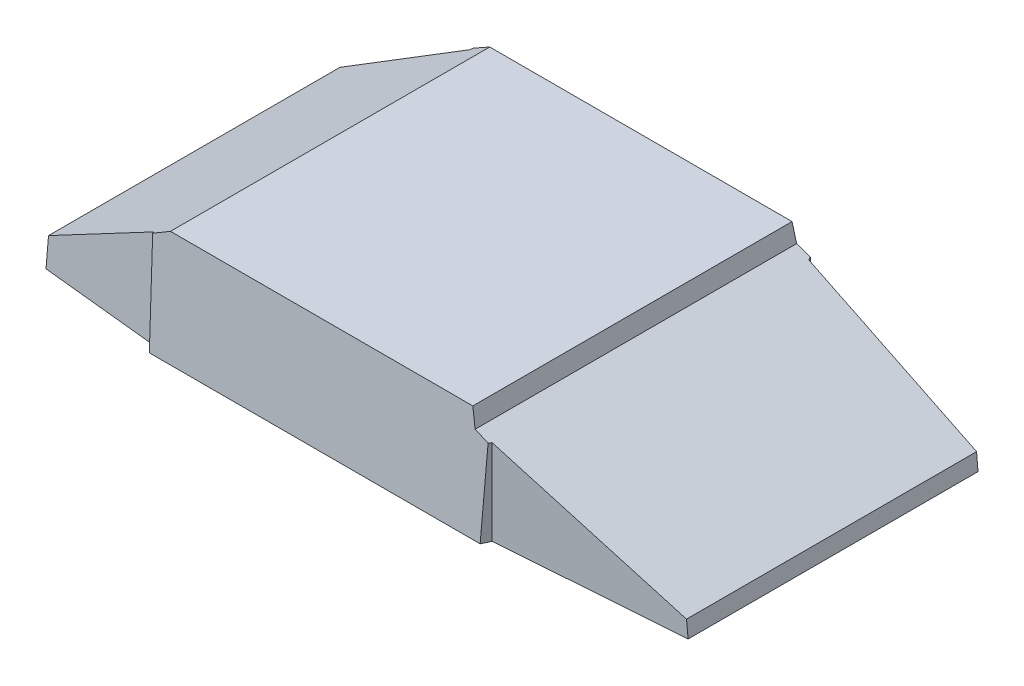
ISO-10303-21;
HEADER;
FILE_DESCRIPTION(('STEP AP214'),'2;1');
FILE_NAME('part.step','',(''),(''),'','','');
FILE_SCHEMA(('AUTOMOTIVE_DESIGN { 1 0 10303 214 1 1 1 1 }'));
ENDSEC;
DATA;
#1=APPLICATION_CONTEXT('core data for automotive mechanical design processes');
#2=APPLICATION_PROTOCOL_DEFINITION('international standard','automotive_design',2000,#1);
#3=PRODUCT_CONTEXT('',#1,'mechanical');
#4=PRODUCT('Part','Part','',(#3));
#5=PRODUCT_RELATED_PRODUCT_CATEGORY('part','',(#4));
#6=PRODUCT_DEFINITION_FORMATION('','',#4);
#7=PRODUCT_DEFINITION_CONTEXT('part definition',#1,'design');
#8=PRODUCT_DEFINITION('design','',#6,#7);
#9=PRODUCT_DEFINITION_SHAPE('','',#8);
#10=(LENGTH_UNIT() NAMED_UNIT(*) SI_UNIT(.MILLI.,.METRE.));
#11=(NAMED_UNIT(*) PLANE_ANGLE_UNIT() SI_UNIT($,.RADIAN.));
#12=(NAMED_UNIT(*) SI_UNIT($,.STERADIAN.) SOLID_ANGLE_UNIT());
#13=UNCERTAINTY_MEASURE_WITH_UNIT(LENGTH_MEASURE(1.E-05),#10,'distance_accuracy_value','');
#14=(GEOMETRIC_REPRESENTATION_CONTEXT(3) GLOBAL_UNCERTAINTY_ASSIGNED_CONTEXT((#13)) GLOBAL_UNIT_ASSIGNED_CONTEXT((#10,
#11,#12)) REPRESENTATION_CONTEXT('',''));
#15=CARTESIAN_POINT('',(0.,0.,0.));
#16=DIRECTION('',(0.,0.,1.));
#17=DIRECTION('',(1.,0.,0.));
#18=AXIS2_PLACEMENT_3D('',#15,#16,#17);
#19=CARTESIAN_POINT('',(0.,158.,0.));
#20=DIRECTION('',(0.,1.,0.));
#21=DIRECTION('',(0.,0.,1.));
#22=AXIS2_PLACEMENT_3D('',#19,#20,#21);
#23=PLANE('',#22);
#24=DIRECTION('',(1.,0.,0.));
#25=VECTOR('',#24,1.);
#26=CARTESIAN_POINT('',(-180.,158.,84.9999999999999));
#27=LINE('',#26,#25);
#28=CARTESIAN_POINT('',(-97.,158.,84.9999999999999));
#29=VERTEX_POINT('',#28);
#30=CARTESIAN_POINT('',(64.,158.,85.));
#31=VERTEX_POINT('',#30);
#32=EDGE_CURVE('E355',#29,#31,#27,.T.);
#33=ORIENTED_EDGE('',*,*,#32,.T.);
#34=DIRECTION('',(0.,0.,-1.));
#35=VECTOR('',#34,1.);
#36=CARTESIAN_POINT('',(64.,158.,95.));
#37=LINE('',#36,#35);
#38=CARTESIAN_POINT('',(64.,158.,-85.0000000000001));
#39=VERTEX_POINT('',#38);
#40=EDGE_CURVE('E349',#31,#39,#37,.T.);
#41=ORIENTED_EDGE('',*,*,#40,.T.);
#42=DIRECTION('',(1.,0.,0.));
#43=VECTOR('',#42,1.);
#44=CARTESIAN_POINT('',(-180.,158.,-85.0000000000001));
#45=LINE('',#44,#43);
#46=CARTESIAN_POINT('',(-97.,158.,-84.9999999999999));
#47=VERTEX_POINT('',#46);
#48=EDGE_CURVE('E352',#47,#39,#45,.T.);
#49=ORIENTED_EDGE('',*,*,#48,.F.);
#50=DIRECTION('',(0.,0.,-1.));
#51=VECTOR('',#50,1.);
#52=CARTESIAN_POINT('',(-97.,158.,95.));
#53=LINE('',#52,#51);
#54=EDGE_CURVE('E346',#29,#47,#53,.T.);
#55=ORIENTED_EDGE('',*,*,#54,.F.);
#56=EDGE_LOOP('',(#33,#41,#49,#55));
#57=FACE_BOUND('',#56,.T.);
#58=ADVANCED_FACE('F43',(#57),#23,.T.);
#59=CARTESIAN_POINT('',(-180.,158.,-85.0000000000001));
#60=DIRECTION('',(0.,-0.063164753996691,0.998003113147718));
#61=DIRECTION('',(0.,-0.998003113147719,-0.063164753996691));
#62=AXIS2_PLACEMENT_3D('',#59,#60,#61);
#63=PLANE('',#62);
#64=DIRECTION('',(0.0294414403161479,0.997570485622409,0.0631373725077474));
#65=VECTOR('',#64,1.);
#66=CARTESIAN_POINT('',(73.0599801105196,150.561202737672,-85.4708099533119));
#67=LINE('',#66,#65);
#68=CARTESIAN_POINT('',(72.9178759529951,145.746257819608,-85.7755533025565));
#69=VERTEX_POINT('',#68);
#70=CARTESIAN_POINT('',(71.5677601078548,100.,-88.6708860759494));
#71=VERTEX_POINT('',#70);
#72=EDGE_CURVE('E412',#69,#71,#67,.F.);
#73=ORIENTED_EDGE('',*,*,#72,.T.);
#74=DIRECTION('',(-1.,0.,0.));
#75=VECTOR('',#74,1.);
#76=CARTESIAN_POINT('',(-180.,100.,-88.6708860759495));
#77=LINE('',#76,#75);
#78=CARTESIAN_POINT('',(-104.567760107855,100.,-88.6708860759494));
#79=VERTEX_POINT('',#78);
#80=EDGE_CURVE('E59',#71,#79,#77,.T.);
#81=ORIENTED_EDGE('',*,*,#80,.T.);
#82=DIRECTION('',(0.029441440316148,-0.997570485622409,-0.0631373725077474));
#83=VECTOR('',#82,1.);
#84=CARTESIAN_POINT('',(-106.343423189899,160.16516393342,-84.8629643080114));
#85=LINE('',#84,#83);
#86=CARTESIAN_POINT('',(-106.123798843026,152.723586211262,-85.3339502397936));
#87=VERTEX_POINT('',#86);
#88=EDGE_CURVE('E384',#79,#87,#85,.F.);
#89=ORIENTED_EDGE('',*,*,#88,.T.);
#90=DIRECTION('',(-0.865229995951052,-0.500373973562054,-0.0316692388330415));
#91=VECTOR('',#90,1.);
#92=CARTESIAN_POINT('',(-159.135704509157,122.066098597114,-87.2742975571448));
#93=LINE('',#92,#91);
#94=EDGE_CURVE('E392',#47,#87,#93,.T.);
#95=ORIENTED_EDGE('',*,*,#94,.F.);
#96=ORIENTED_EDGE('',*,*,#48,.T.);
#97=DIRECTION('',(0.187628780777024,-0.980278589555026,-0.0620429487060142));
#98=VECTOR('',#97,1.);
#99=CARTESIAN_POINT('',(63.726694688933,159.427901112724,-84.9096265118529));
#100=LINE('',#99,#98);
#101=CARTESIAN_POINT('',(65.8291232913641,148.443628143001,-85.6048336618354));
#102=VERTEX_POINT('',#101);
#103=EDGE_CURVE('E418',#39,#102,#100,.T.);
#104=ORIENTED_EDGE('',*,*,#103,.T.);
#105=DIRECTION('',(0.934387269483992,-0.35554752882042,-0.022503008153191));
#106=VECTOR('',#105,1.);
#107=CARTESIAN_POINT('',(62.0316313598313,149.888627359137,-85.5133780152445));
#108=LINE('',#107,#106);
#109=EDGE_CURVE('E52',#102,#69,#108,.T.);
#110=ORIENTED_EDGE('',*,*,#109,.T.);
#111=EDGE_LOOP('',(#73,#81,#89,#95,#96,#104,#110));
#112=FACE_BOUND('',#111,.T.);
#113=ADVANCED_FACE('F424',(#112),#63,.F.);
#114=CARTESIAN_POINT('',(-180.,158.,84.9999999999999));
#115=DIRECTION('',(0.,-0.063164753996691,-0.998003113147718));
#116=DIRECTION('',(0.,0.998003113147719,-0.063164753996691));
#117=AXIS2_PLACEMENT_3D('',#114,#115,#116);
#118=PLANE('',#117);
#119=DIRECTION('',(-0.0294414403161479,0.997570485622409,-0.0631373725077474));
#120=VECTOR('',#119,1.);
#121=CARTESIAN_POINT('',(-106.3434231899,160.16516393342,84.8629643080113));
#122=LINE('',#121,#120);
#123=CARTESIAN_POINT('',(-106.123798843026,152.723586211262,85.3339502397935));
#124=VERTEX_POINT('',#123);
#125=CARTESIAN_POINT('',(-104.567760107855,100.,88.6708860759493));
#126=VERTEX_POINT('',#125);
#127=EDGE_CURVE('E407',#124,#126,#122,.F.);
#128=ORIENTED_EDGE('',*,*,#127,.T.);
#129=DIRECTION('',(1.,0.,0.));
#130=VECTOR('',#129,1.);
#131=CARTESIAN_POINT('',(-180.,100.,88.6708860759493));
#132=LINE('',#131,#130);
#133=CARTESIAN_POINT('',(71.5677601078549,100.,88.6708860759493));
#134=VERTEX_POINT('',#133);
#135=EDGE_CURVE('E462',#126,#134,#132,.T.);
#136=ORIENTED_EDGE('',*,*,#135,.T.);
#137=DIRECTION('',(-0.029441440316148,-0.997570485622409,0.0631373725077474));
#138=VECTOR('',#137,1.);
#139=CARTESIAN_POINT('',(73.0599801105197,150.561202737672,85.4708099533118));
#140=LINE('',#139,#138);
#141=CARTESIAN_POINT('',(72.9178759529952,145.746257819608,85.7755533025564));
#142=VERTEX_POINT('',#141);
#143=EDGE_CURVE('E388',#134,#142,#140,.F.);
#144=ORIENTED_EDGE('',*,*,#143,.T.);
#145=DIRECTION('',(0.934387269483992,-0.35554752882042,0.0225030081531912));
#146=VECTOR('',#145,1.);
#147=CARTESIAN_POINT('',(-151.986788471782,231.325653288657,80.3591358678065));
#148=LINE('',#147,#146);
#149=CARTESIAN_POINT('',(65.8291232913641,148.443628143001,85.6048336618354));
#150=VERTEX_POINT('',#149);
#151=EDGE_CURVE('E398',#150,#142,#148,.T.);
#152=ORIENTED_EDGE('',*,*,#151,.F.);
#153=DIRECTION('',(0.187628780777024,-0.980278589555026,0.0620429487060143));
#154=VECTOR('',#153,1.);
#155=CARTESIAN_POINT('',(55.4100875122871,202.878548285527,82.1595855515489));
#156=LINE('',#155,#154);
#157=EDGE_CURVE('E395',#31,#150,#156,.T.);
#158=ORIENTED_EDGE('',*,*,#157,.F.);
#159=ORIENTED_EDGE('',*,*,#32,.F.);
#160=DIRECTION('',(-0.865229995951052,-0.500373973562054,0.0316692388330412));
#161=VECTOR('',#160,1.);
#162=CARTESIAN_POINT('',(-97.2740117538728,157.841535371254,85.0100294068826));
#163=LINE('',#162,#161);
#164=EDGE_CURVE('E415',#29,#124,#163,.T.);
#165=ORIENTED_EDGE('',*,*,#164,.T.);
#166=EDGE_LOOP('',(#128,#136,#144,#152,#158,#159,#165));
#167=FACE_BOUND('',#166,.T.);
#168=ADVANCED_FACE('F549',(#167),#118,.F.);
#169=CARTESIAN_POINT('',(180.,0.,-95.0000000000001));
#170=DIRECTION('',(-0.9958153503349,-0.0913881175940254,0.));
#171=DIRECTION('',(0.0913881175940254,-0.995815350334901,0.));
#172=AXIS2_PLACEMENT_3D('',#169,#170,#171);
#173=PLANE('',#172);
#174=DIRECTION('',(0.0913860685727554,-0.995793023068648,-0.00669639295576236));
#175=VECTOR('',#174,1.);
#176=CARTESIAN_POINT('',(180.104950629932,-1.14359996754022,76.4923096521169));
#177=LINE('',#176,#175);
#178=CARTESIAN_POINT('',(170.015250636154,108.799337895696,77.2316411171782));
#179=VERTEX_POINT('',#178);
#180=CARTESIAN_POINT('',(170.822784810127,100.,77.1724683544303));
#181=VERTEX_POINT('',#180);
#182=EDGE_CURVE('E336',#179,#181,#177,.T.);
#183=ORIENTED_EDGE('',*,*,#182,.T.);
#184=DIRECTION('',(0.,0.,-1.));
#185=VECTOR('',#184,1.);
#186=CARTESIAN_POINT('',(170.822784810127,100.,-95.0000000000001));
#187=LINE('',#186,#185);
#188=CARTESIAN_POINT('',(170.822784810127,100.,-77.1724683544304));
#189=VERTEX_POINT('',#188);
#190=EDGE_CURVE('E435',#181,#189,#187,.T.);
#191=ORIENTED_EDGE('',*,*,#190,.T.);
#192=DIRECTION('',(-0.0913860685727554,0.995793023068648,-0.00669639295576233));
#193=VECTOR('',#192,1.);
#194=CARTESIAN_POINT('',(179.988678795022,0.123362095623873,-76.5008295710544));
#195=LINE('',#194,#193);
#196=CARTESIAN_POINT('',(170.015250636154,108.799337895696,-77.2316411171783));
#197=VERTEX_POINT('',#196);
#198=EDGE_CURVE('E339',#189,#197,#195,.T.);
#199=ORIENTED_EDGE('',*,*,#198,.T.);
#200=DIRECTION('',(0.,0.,-1.));
#201=VECTOR('',#200,1.);
#202=CARTESIAN_POINT('',(170.015250636154,108.799337895696,-95.0000000000001));
#203=LINE('',#202,#201);
#204=EDGE_CURVE('E363',#179,#197,#203,.T.);
#205=ORIENTED_EDGE('',*,*,#204,.F.);
#206=EDGE_LOOP('',(#183,#191,#199,#205));
#207=FACE_BOUND('',#206,.T.);
#208=ADVANCED_FACE('F610',(#207),#173,.F.);
#209=CARTESIAN_POINT('',(-180.,0.,-95.0000000000001));
#210=DIRECTION('',(0.9958153503349,-0.0913881175940254,0.));
#211=DIRECTION('',(0.0913881175940254,0.995815350334901,0.));
#212=AXIS2_PLACEMENT_3D('',#209,#210,#211);
#213=PLANE('',#212);
#214=DIRECTION('',(-0.0913841154534666,-0.995771740803294,0.00935861423318627));
#215=VECTOR('',#214,1.);
#216=CARTESIAN_POINT('',(-179.984178269354,0.172402306349999,-76.5016202977167));
#217=LINE('',#216,#215);
#218=CARTESIAN_POINT('',(-169.339265582219,116.165244000644,-77.5917619584474));
#219=VERTEX_POINT('',#218);
#220=CARTESIAN_POINT('',(-170.822784810127,100.,-77.4398352905292));
#221=VERTEX_POINT('',#220);
#222=EDGE_CURVE('E341',#219,#221,#217,.T.);
#223=ORIENTED_EDGE('',*,*,#222,.T.);
#224=DIRECTION('',(0.,0.,1.));
#225=VECTOR('',#224,1.);
#226=CARTESIAN_POINT('',(-170.822784810127,100.,-95.0000000000001));
#227=LINE('',#226,#225);
#228=CARTESIAN_POINT('',(-170.822784810127,100.,77.4398352905292));
#229=VERTEX_POINT('',#228);
#230=EDGE_CURVE('E453',#221,#229,#227,.T.);
#231=ORIENTED_EDGE('',*,*,#230,.T.);
#232=DIRECTION('',(0.0913841154534666,0.995771740803294,0.00935861423318624));
#233=VECTOR('',#232,1.);
#234=CARTESIAN_POINT('',(-180.146671719232,-1.59821597508241,76.4849794022473));
#235=LINE('',#234,#233);
#236=CARTESIAN_POINT('',(-169.339265582219,116.165244000644,77.5917619584474));
#237=VERTEX_POINT('',#236);
#238=EDGE_CURVE('E344',#229,#237,#235,.T.);
#239=ORIENTED_EDGE('',*,*,#238,.T.);
#240=DIRECTION('',(0.,0.,1.));
#241=VECTOR('',#240,1.);
#242=CARTESIAN_POINT('',(-169.339265582219,116.165244000644,-95.0000000000001));
#243=LINE('',#242,#241);
#244=EDGE_CURVE('E358',#219,#237,#243,.T.);
#245=ORIENTED_EDGE('',*,*,#244,.F.);
#246=EDGE_LOOP('',(#223,#231,#239,#245));
#247=FACE_BOUND('',#246,.T.);
#248=ADVANCED_FACE('F583',(#247),#213,.F.);
#249=CARTESIAN_POINT('',(-97.,158.,95.));
#250=DIRECTION('',(-0.500625085174105,0.865664209780224,0.));
#251=DIRECTION('',(-0.865664209780224,-0.500625085174106,0.));
#252=AXIS2_PLACEMENT_3D('',#249,#250,#251);
#253=PLANE('',#252);
#254=DIRECTION('',(-0.862282398918557,-0.498669339133623,-0.0883060288049115));
#255=VECTOR('',#254,1.);
#256=CARTESIAN_POINT('',(-96.2385526564313,158.440355090257,85.0779795472329));
#257=LINE('',#256,#255);
#258=CARTESIAN_POINT('',(-106.744883446956,152.364404753568,84.0020300084442));
#259=VERTEX_POINT('',#258);
#260=EDGE_CURVE('E375',#259,#237,#257,.T.);
#261=ORIENTED_EDGE('',*,*,#260,.F.);
#262=DIRECTION('',(-0.410534624247137,-0.237417614022441,-0.880394342806764));
#263=VECTOR('',#262,1.);
#264=CARTESIAN_POINT('',(-121.595561420384,143.77606086532,52.1546483201699));
#265=LINE('',#264,#263);
#266=EDGE_CURVE('E405',#259,#124,#265,.F.);
#267=ORIENTED_EDGE('',*,*,#266,.T.);
#268=ORIENTED_EDGE('',*,*,#164,.F.);
#269=ORIENTED_EDGE('',*,*,#54,.T.);
#270=ORIENTED_EDGE('',*,*,#94,.T.);
#271=DIRECTION('',(0.410534624247138,0.237417614022441,-0.880394342806763));
#272=VECTOR('',#271,1.);
#273=CARTESIAN_POINT('',(-112.39996902167,149.093993818793,-71.8746598573967));
#274=LINE('',#273,#272);
#275=CARTESIAN_POINT('',(-106.744883446956,152.364404753568,-84.0020300084442));
#276=VERTEX_POINT('',#275);
#277=EDGE_CURVE('E386',#87,#276,#274,.F.);
#278=ORIENTED_EDGE('',*,*,#277,.T.);
#279=DIRECTION('',(0.862282398918557,0.498669339133623,-0.0883060288049118));
#280=VECTOR('',#279,1.);
#281=CARTESIAN_POINT('',(-110.706052184237,150.073608375381,-83.596368149807));
#282=LINE('',#281,#280);
#283=EDGE_CURVE('E372',#219,#276,#282,.T.);
#284=ORIENTED_EDGE('',*,*,#283,.F.);
#285=ORIENTED_EDGE('',*,*,#244,.T.);
#286=EDGE_LOOP('',(#261,#267,#268,#269,#270,#278,#284,#285));
#287=FACE_BOUND('',#286,.T.);
#288=ADVANCED_FACE('F590',(#287),#253,.T.);
#289=CARTESIAN_POINT('',(65.8291232913641,148.443628143001,95.));
#290=DIRECTION('',(0.982170760658832,0.187990949002477,0.));
#291=DIRECTION('',(-0.187990949002477,0.982170760658832,0.));
#292=AXIS2_PLACEMENT_3D('',#289,#290,#291);
#293=PLANE('',#292);
#294=DIRECTION('',(0.,0.,-1.));
#295=VECTOR('',#294,1.);
#296=CARTESIAN_POINT('',(65.8291232913641,148.443628143001,95.));
#297=LINE('',#296,#295);
#298=EDGE_CURVE('E347',#150,#102,#297,.T.);
#299=ORIENTED_EDGE('',*,*,#298,.T.);
#300=ORIENTED_EDGE('',*,*,#103,.F.);
#301=ORIENTED_EDGE('',*,*,#40,.F.);
#302=ORIENTED_EDGE('',*,*,#157,.T.);
#303=EDGE_LOOP('',(#299,#300,#301,#302));
#304=FACE_BOUND('',#303,.T.);
#305=ADVANCED_FACE('F598',(#304),#293,.T.);
#306=CARTESIAN_POINT('',(65.8291232913641,148.443628143001,95.));
#307=DIRECTION('',(0.355637585058758,0.93462393939679,0.));
#308=DIRECTION('',(-0.93462393939679,0.355637585058758,0.));
#309=AXIS2_PLACEMENT_3D('',#306,#307,#308);
#310=PLANE('',#309);
#311=DIRECTION('',(0.932439811112521,-0.354806493455244,0.0683253309866941));
#312=VECTOR('',#311,1.);
#313=CARTESIAN_POINT('',(77.288250871582,144.083268550522,-84.0262919619962));
#314=LINE('',#313,#312);
#315=CARTESIAN_POINT('',(73.6078126672081,145.483727173277,-84.2959792442132));
#316=VERTEX_POINT('',#315);
#317=EDGE_CURVE('E369',#316,#197,#314,.T.);
#318=ORIENTED_EDGE('',*,*,#317,.F.);
#319=DIRECTION('',(0.417257442210607,-0.158772339162795,0.894811472454749));
#320=VECTOR('',#319,1.);
#321=CARTESIAN_POINT('',(83.2459561940035,141.81627768495,-63.6269137501363));
#322=LINE('',#321,#320);
#323=EDGE_CURVE('E410',#316,#69,#322,.F.);
#324=ORIENTED_EDGE('',*,*,#323,.T.);
#325=ORIENTED_EDGE('',*,*,#109,.F.);
#326=ORIENTED_EDGE('',*,*,#298,.F.);
#327=ORIENTED_EDGE('',*,*,#151,.T.);
#328=DIRECTION('',(-0.417257442210608,0.158772339162795,0.894811472454749));
#329=VECTOR('',#328,1.);
#330=CARTESIAN_POINT('',(73.8803435681921,145.380025323373,83.7115348410005));
#331=LINE('',#330,#329);
#332=CARTESIAN_POINT('',(73.6078126672081,145.483727173277,84.2959792442132));
#333=VERTEX_POINT('',#332);
#334=EDGE_CURVE('E390',#142,#333,#331,.F.);
#335=ORIENTED_EDGE('',*,*,#334,.T.);
#336=DIRECTION('',(-0.932439811112521,0.354806493455244,0.0683253309866944));
#337=VECTOR('',#336,1.);
#338=CARTESIAN_POINT('',(65.1834917148896,148.689300059818,84.91327862434));
#339=LINE('',#338,#337);
#340=EDGE_CURVE('E366',#179,#333,#339,.T.);
#341=ORIENTED_EDGE('',*,*,#340,.F.);
#342=ORIENTED_EDGE('',*,*,#204,.T.);
#343=EDGE_LOOP('',(#318,#324,#325,#326,#327,#335,#341,#342));
#344=FACE_BOUND('',#343,.T.);
#345=ADVANCED_FACE('F600',(#344),#310,.T.);
#346=CARTESIAN_POINT('',(64.,-1.2E-05,85.));
#347=DIRECTION('',(-0.0730799287960106,0.,-0.997326087098483));
#348=DIRECTION('',(-0.997326087098483,0.,0.0730799287960106));
#349=AXIS2_PLACEMENT_3D('',#346,#347,#348);
#350=PLANE('',#349);
#351=DIRECTION('',(0.,-1.,0.));
#352=VECTOR('',#351,1.);
#353=CARTESIAN_POINT('',(73.6078126672081,0.,84.2959792442132));
#354=LINE('',#353,#352);
#355=CARTESIAN_POINT('',(73.6078126672081,100.,84.2959792442132));
#356=VERTEX_POINT('',#355);
#357=EDGE_CURVE('E381',#333,#356,#354,.T.);
#358=ORIENTED_EDGE('',*,*,#357,.T.);
#359=DIRECTION('',(0.997326087098483,0.,-0.0730799287960106));
#360=VECTOR('',#359,1.);
#361=CARTESIAN_POINT('',(64.,100.,85.));
#362=LINE('',#361,#360);
#363=EDGE_CURVE('E450',#356,#181,#362,.T.);
#364=ORIENTED_EDGE('',*,*,#363,.T.);
#365=ORIENTED_EDGE('',*,*,#182,.F.);
#366=ORIENTED_EDGE('',*,*,#340,.T.);
#367=EDGE_LOOP('',(#358,#364,#365,#366));
#368=FACE_BOUND('',#367,.T.);
#369=ADVANCED_FACE('F608',(#368),#350,.F.);
#370=CARTESIAN_POINT('',(64.,-1.2E-05,-85.0000000000001));
#371=DIRECTION('',(-0.0730799287960104,0.,0.997326087098483));
#372=DIRECTION('',(0.997326087098483,0.,0.0730799287960104));
#373=AXIS2_PLACEMENT_3D('',#370,#371,#372);
#374=PLANE('',#373);
#375=ORIENTED_EDGE('',*,*,#198,.F.);
#376=DIRECTION('',(-0.997326087098483,0.,-0.0730799287960104));
#377=VECTOR('',#376,1.);
#378=CARTESIAN_POINT('',(64.,100.,-85.0000000000001));
#379=LINE('',#378,#377);
#380=CARTESIAN_POINT('',(73.6078126672081,100.,-84.2959792442132));
#381=VERTEX_POINT('',#380);
#382=EDGE_CURVE('E432',#189,#381,#379,.T.);
#383=ORIENTED_EDGE('',*,*,#382,.T.);
#384=DIRECTION('',(0.,1.,0.));
#385=VECTOR('',#384,1.);
#386=CARTESIAN_POINT('',(73.6078126672081,158.,-84.2959792442133));
#387=LINE('',#386,#385);
#388=EDGE_CURVE('E403',#381,#316,#387,.T.);
#389=ORIENTED_EDGE('',*,*,#388,.T.);
#390=ORIENTED_EDGE('',*,*,#317,.T.);
#391=EDGE_LOOP('',(#375,#383,#389,#390));
#392=FACE_BOUND('',#391,.T.);
#393=ADVANCED_FACE('F613',(#392),#374,.F.);
#394=CARTESIAN_POINT('',(-180.,-1.2E-05,-76.5));
#395=DIRECTION('',(0.101876803556506,0.,0.994797022963534));
#396=DIRECTION('',(0.994797022963534,0.,-0.101876803556506));
#397=AXIS2_PLACEMENT_3D('',#394,#395,#396);
#398=PLANE('',#397);
#399=DIRECTION('',(0.,-1.,0.));
#400=VECTOR('',#399,1.);
#401=CARTESIAN_POINT('',(-106.744883446956,0.,-84.0020300084442));
#402=LINE('',#401,#400);
#403=CARTESIAN_POINT('',(-106.744883446956,100.,-84.0020300084442));
#404=VERTEX_POINT('',#403);
#405=EDGE_CURVE('E378',#276,#404,#402,.T.);
#406=ORIENTED_EDGE('',*,*,#405,.T.);
#407=DIRECTION('',(-0.994797022963534,0.,0.101876803556506));
#408=VECTOR('',#407,1.);
#409=CARTESIAN_POINT('',(-180.,100.,-76.5));
#410=LINE('',#409,#408);
#411=EDGE_CURVE('E447',#404,#221,#410,.T.);
#412=ORIENTED_EDGE('',*,*,#411,.T.);
#413=ORIENTED_EDGE('',*,*,#222,.F.);
#414=ORIENTED_EDGE('',*,*,#283,.T.);
#415=EDGE_LOOP('',(#406,#412,#413,#414));
#416=FACE_BOUND('',#415,.T.);
#417=ADVANCED_FACE('F587',(#416),#398,.F.);
#418=CARTESIAN_POINT('',(-180.,-1.2E-05,76.5));
#419=DIRECTION('',(0.101876803556505,0.,-0.994797022963534));
#420=DIRECTION('',(-0.994797022963534,0.,-0.101876803556505));
#421=AXIS2_PLACEMENT_3D('',#418,#419,#420);
#422=PLANE('',#421);
#423=ORIENTED_EDGE('',*,*,#238,.F.);
#424=DIRECTION('',(0.994797022963534,0.,0.101876803556505));
#425=VECTOR('',#424,1.);
#426=CARTESIAN_POINT('',(-180.,100.,76.5));
#427=LINE('',#426,#425);
#428=CARTESIAN_POINT('',(-106.744883446956,100.,84.0020300084442));
#429=VERTEX_POINT('',#428);
#430=EDGE_CURVE('E459',#229,#429,#427,.T.);
#431=ORIENTED_EDGE('',*,*,#430,.T.);
#432=DIRECTION('',(0.,1.,0.));
#433=VECTOR('',#432,1.);
#434=CARTESIAN_POINT('',(-106.744883446956,158.,84.0020300084442));
#435=LINE('',#434,#433);
#436=EDGE_CURVE('E401',#429,#259,#435,.T.);
#437=ORIENTED_EDGE('',*,*,#436,.T.);
#438=ORIENTED_EDGE('',*,*,#260,.T.);
#439=EDGE_LOOP('',(#423,#431,#437,#438));
#440=FACE_BOUND('',#439,.T.);
#441=ADVANCED_FACE('F561',(#440),#422,.F.);
#442=CARTESIAN_POINT('',(-97.,-1.2E-05,-104.9));
#443=DIRECTION('',(-0.906307787036647,0.,-0.422618261740706));
#444=DIRECTION('',(0.,-1.,0.));
#445=AXIS2_PLACEMENT_3D('',#442,#443,#444);
#446=PLANE('',#445);
#447=ORIENTED_EDGE('',*,*,#88,.F.);
#448=DIRECTION('',(0.422618261740706,0.,-0.906307787036647));
#449=VECTOR('',#448,1.);
#450=CARTESIAN_POINT('',(-97.,100.,-104.9));
#451=LINE('',#450,#449);
#452=EDGE_CURVE('E444',#79,#404,#451,.F.);
#453=ORIENTED_EDGE('',*,*,#452,.T.);
#454=ORIENTED_EDGE('',*,*,#405,.F.);
#455=ORIENTED_EDGE('',*,*,#277,.F.);
#456=EDGE_LOOP('',(#447,#453,#454,#455));
#457=FACE_BOUND('',#456,.T.);
#458=ADVANCED_FACE('F554',(#457),#446,.T.);
#459=CARTESIAN_POINT('',(64.,-1.2E-05,104.9));
#460=DIRECTION('',(0.906307787036647,0.,0.422618261740706));
#461=DIRECTION('',(0.,-1.,0.));
#462=AXIS2_PLACEMENT_3D('',#459,#460,#461);
#463=PLANE('',#462);
#464=ORIENTED_EDGE('',*,*,#143,.F.);
#465=DIRECTION('',(-0.422618261740706,0.,0.906307787036647));
#466=VECTOR('',#465,1.);
#467=CARTESIAN_POINT('',(64.,100.,104.9));
#468=LINE('',#467,#466);
#469=EDGE_CURVE('E456',#134,#356,#468,.F.);
#470=ORIENTED_EDGE('',*,*,#469,.T.);
#471=ORIENTED_EDGE('',*,*,#357,.F.);
#472=ORIENTED_EDGE('',*,*,#334,.F.);
#473=EDGE_LOOP('',(#464,#470,#471,#472));
#474=FACE_BOUND('',#473,.T.);
#475=ADVANCED_FACE('F560',(#474),#463,.T.);
#476=CARTESIAN_POINT('',(-106.744883446956,-1.2E-05,84.0020300084442));
#477=DIRECTION('',(-0.906307787036648,0.,0.422618261740704));
#478=DIRECTION('',(0.,-1.,0.));
#479=AXIS2_PLACEMENT_3D('',#476,#477,#478);
#480=PLANE('',#479);
#481=ORIENTED_EDGE('',*,*,#436,.F.);
#482=DIRECTION('',(-0.422618261740704,0.,-0.906307787036648));
#483=VECTOR('',#482,1.);
#484=CARTESIAN_POINT('',(-106.744883446956,100.,84.0020300084442));
#485=LINE('',#484,#483);
#486=EDGE_CURVE('E311',#429,#126,#485,.F.);
#487=ORIENTED_EDGE('',*,*,#486,.T.);
#488=ORIENTED_EDGE('',*,*,#127,.F.);
#489=ORIENTED_EDGE('',*,*,#266,.F.);
#490=EDGE_LOOP('',(#481,#487,#488,#489));
#491=FACE_BOUND('',#490,.T.);
#492=ADVANCED_FACE('F567',(#491),#480,.T.);
#493=CARTESIAN_POINT('',(73.6078126672081,-1.2E-05,-84.2959792442133));
#494=DIRECTION('',(0.906307787036647,0.,-0.422618261740705));
#495=DIRECTION('',(0.,-1.,0.));
#496=AXIS2_PLACEMENT_3D('',#493,#494,#495);
#497=PLANE('',#496);
#498=ORIENTED_EDGE('',*,*,#388,.F.);
#499=DIRECTION('',(0.422618261740705,0.,0.906307787036647));
#500=VECTOR('',#499,1.);
#501=CARTESIAN_POINT('',(73.6078126672081,100.,-84.2959792442133));
#502=LINE('',#501,#500);
#503=EDGE_CURVE('E430',#381,#71,#502,.F.);
#504=ORIENTED_EDGE('',*,*,#503,.T.);
#505=ORIENTED_EDGE('',*,*,#72,.F.);
#506=ORIENTED_EDGE('',*,*,#323,.F.);
#507=EDGE_LOOP('',(#498,#504,#505,#506));
#508=FACE_BOUND('',#507,.T.);
#509=ADVANCED_FACE('F46',(#508),#497,.T.);
#510=CARTESIAN_POINT('',(-208.874829296963,100.,-95.0000000000001));
#511=DIRECTION('',(0.,1.,0.));
#512=DIRECTION('',(0.,0.,1.));
#513=AXIS2_PLACEMENT_3D('',#510,#511,#512);
#514=PLANE('',#513);
#515=DIRECTION('',(0.,0.,-1.));
#516=VECTOR('',#515,1.);
#517=CARTESIAN_POINT('',(59.,100.,85.));
#518=LINE('',#517,#516);
#519=CARTESIAN_POINT('',(59.,100.,83.6608816640092));
#520=VERTEX_POINT('',#519);
#521=CARTESIAN_POINT('',(59.,100.,80.3529739009401));
#522=VERTEX_POINT('',#521);
#523=EDGE_CURVE('E433',#520,#522,#518,.T.);
#524=ORIENTED_EDGE('',*,*,#523,.T.);
#525=DIRECTION('',(0.997326087098483,0.,-0.0730799287960106));
#526=VECTOR('',#525,1.);
#527=CARTESIAN_POINT('',(63.6346003560199,100.,80.0133695645076));
#528=LINE('',#527,#526);
#529=CARTESIAN_POINT('',(165.801773637404,100.,72.5269818671647));
#530=VERTEX_POINT('',#529);
#531=EDGE_CURVE('E486',#522,#530,#528,.T.);
#532=ORIENTED_EDGE('',*,*,#531,.T.);
#533=DIRECTION('',(0.,0.,-1.));
#534=VECTOR('',#533,1.);
#535=CARTESIAN_POINT('',(165.801773637404,100.,-95.0000000000001));
#536=LINE('',#535,#534);
#537=CARTESIAN_POINT('',(165.801773637404,100.,-72.5269818671648));
#538=VERTEX_POINT('',#537);
#539=EDGE_CURVE('E484',#530,#538,#536,.T.);
#540=ORIENTED_EDGE('',*,*,#539,.T.);
#541=DIRECTION('',(-0.997326087098483,0.,-0.0730799287960104));
#542=VECTOR('',#541,1.);
#543=CARTESIAN_POINT('',(63.6346003560199,100.,-80.0133695645077));
#544=LINE('',#543,#542);
#545=CARTESIAN_POINT('',(59.,100.,-80.3529739009402));
#546=VERTEX_POINT('',#545);
#547=EDGE_CURVE('E253',#538,#546,#544,.T.);
#548=ORIENTED_EDGE('',*,*,#547,.T.);
#549=DIRECTION('',(0.,0.,-1.));
#550=VECTOR('',#549,1.);
#551=CARTESIAN_POINT('',(59.,100.,-85.0000000000001));
#552=LINE('',#551,#550);
#553=CARTESIAN_POINT('',(59.,100.,-83.6608816640093));
#554=VERTEX_POINT('',#553);
#555=EDGE_CURVE('E66',#546,#554,#552,.T.);
#556=ORIENTED_EDGE('',*,*,#555,.T.);
#557=DIRECTION('',(-1.,0.,0.));
#558=VECTOR('',#557,1.);
#559=CARTESIAN_POINT('',(-180.,100.,-83.6608816640094));
#560=LINE('',#559,#558);
#561=CARTESIAN_POINT('',(-92.,100.,-83.6608816640094));
#562=VERTEX_POINT('',#561);
#563=EDGE_CURVE('E11',#554,#562,#560,.T.);
#564=ORIENTED_EDGE('',*,*,#563,.T.);
#565=DIRECTION('',(0.,0.,1.));
#566=VECTOR('',#565,1.);
#567=CARTESIAN_POINT('',(-92.,100.,-111.816093371051));
#568=LINE('',#567,#566);
#569=CARTESIAN_POINT('',(-92.,100.,-80.4858972448069));
#570=VERTEX_POINT('',#569);
#571=EDGE_CURVE('E239',#562,#570,#568,.T.);
#572=ORIENTED_EDGE('',*,*,#571,.T.);
#573=DIRECTION('',(-0.994797022963534,0.,0.101876803556506));
#574=VECTOR('',#573,1.);
#575=CARTESIAN_POINT('',(-179.490615982217,100.,-71.5260148851823));
#576=LINE('',#575,#574);
#577=CARTESIAN_POINT('',(-165.801773637404,100.,-72.9278842819403));
#578=VERTEX_POINT('',#577);
#579=EDGE_CURVE('E252',#570,#578,#576,.T.);
#580=ORIENTED_EDGE('',*,*,#579,.T.);
#581=DIRECTION('',(0.,0.,1.));
#582=VECTOR('',#581,1.);
#583=CARTESIAN_POINT('',(-165.801773637404,100.,-95.0000000000001));
#584=LINE('',#583,#582);
#585=CARTESIAN_POINT('',(-165.801773637404,100.,72.9278842819403));
#586=VERTEX_POINT('',#585);
#587=EDGE_CURVE('E491',#578,#586,#584,.T.);
#588=ORIENTED_EDGE('',*,*,#587,.T.);
#589=DIRECTION('',(0.994797022963534,0.,0.101876803556505));
#590=VECTOR('',#589,1.);
#591=CARTESIAN_POINT('',(-179.490615982217,100.,71.5260148851824));
#592=LINE('',#591,#590);
#593=CARTESIAN_POINT('',(-92.,100.,80.4858972448069));
#594=VERTEX_POINT('',#593);
#595=EDGE_CURVE('E493',#586,#594,#592,.T.);
#596=ORIENTED_EDGE('',*,*,#595,.T.);
#597=DIRECTION('',(0.,0.,1.));
#598=VECTOR('',#597,1.);
#599=CARTESIAN_POINT('',(-92.,100.,111.816093371051));
#600=LINE('',#599,#598);
#601=CARTESIAN_POINT('',(-92.,100.,83.6608816640092));
#602=VERTEX_POINT('',#601);
#603=EDGE_CURVE('E495',#594,#602,#600,.T.);
#604=ORIENTED_EDGE('',*,*,#603,.T.);
#605=DIRECTION('',(1.,0.,0.));
#606=VECTOR('',#605,1.);
#607=CARTESIAN_POINT('',(-180.,100.,83.6608816640092));
#608=LINE('',#607,#606);
#609=EDGE_CURVE('E437',#602,#520,#608,.T.);
#610=ORIENTED_EDGE('',*,*,#609,.T.);
#611=EDGE_LOOP('',(#524,#532,#540,#548,#556,#564,#572,#580,#588,#596,#604,#610));
#612=FACE_BOUND('',#611,.T.);
#613=ORIENTED_EDGE('',*,*,#430,.F.);
#614=ORIENTED_EDGE('',*,*,#230,.F.);
#615=ORIENTED_EDGE('',*,*,#411,.F.);
#616=ORIENTED_EDGE('',*,*,#452,.F.);
#617=ORIENTED_EDGE('',*,*,#80,.F.);
#618=ORIENTED_EDGE('',*,*,#503,.F.);
#619=ORIENTED_EDGE('',*,*,#382,.F.);
#620=ORIENTED_EDGE('',*,*,#190,.F.);
#621=ORIENTED_EDGE('',*,*,#363,.F.);
#622=ORIENTED_EDGE('',*,*,#469,.F.);
#623=ORIENTED_EDGE('',*,*,#135,.F.);
#624=ORIENTED_EDGE('',*,*,#486,.F.);
#625=EDGE_LOOP('',(#613,#614,#615,#616,#617,#618,#619,#620,#621,#622,#623,#624));
#626=FACE_BOUND('',#625,.T.);
#627=ADVANCED_FACE('F238',(#612,#626),#514,.F.);
#628=CARTESIAN_POINT('',(60.9182694880699,147.503673397988,95.));
#629=DIRECTION('',(0.982170760658832,0.187990949002477,0.));
#630=DIRECTION('',(-0.187990949002477,0.982170760658832,0.));
#631=AXIS2_PLACEMENT_3D('',#628,#629,#630);
#632=PLANE('',#631);
#633=DIRECTION('',(0.1879731153255,-0.98207758747058,0.0137738920712653));
#634=VECTOR('',#633,1.);
#635=CARTESIAN_POINT('',(61.3719156915558,145.133569735488,-80.1791697338865));
#636=LINE('',#635,#634);
#637=CARTESIAN_POINT('',(59.8662531836478,153.,-80.2894984521384));
#638=VERTEX_POINT('',#637);
#639=CARTESIAN_POINT('',(61.4428597437298,144.762917988381,-80.1739712473048));
#640=VERTEX_POINT('',#639);
#641=EDGE_CURVE('E288',#638,#640,#636,.T.);
#642=ORIENTED_EDGE('',*,*,#641,.T.);
#643=DIRECTION('',(0.,0.,-1.));
#644=VECTOR('',#643,1.);
#645=CARTESIAN_POINT('',(61.4428597437298,144.762917988381,95.));
#646=LINE('',#645,#644);
#647=CARTESIAN_POINT('',(61.4428597437298,144.762917988381,80.1739712473048));
#648=VERTEX_POINT('',#647);
#649=EDGE_CURVE('E294',#648,#640,#646,.T.);
#650=ORIENTED_EDGE('',*,*,#649,.F.);
#651=DIRECTION('',(-0.1879731153255,0.98207758747058,0.0137738920712653));
#652=VECTOR('',#651,1.);
#653=CARTESIAN_POINT('',(60.8799826250251,147.703705567619,80.2152165534168));
#654=LINE('',#653,#652);
#655=CARTESIAN_POINT('',(59.8662531836478,153.,80.2894984521384));
#656=VERTEX_POINT('',#655);
#657=EDGE_CURVE('E291',#648,#656,#654,.T.);
#658=ORIENTED_EDGE('',*,*,#657,.T.);
#659=DIRECTION('',(0.,0.,-1.));
#660=VECTOR('',#659,1.);
#661=CARTESIAN_POINT('',(59.8662531836478,153.,0.));
#662=LINE('',#661,#660);
#663=EDGE_CURVE('E297',#656,#638,#662,.T.);
#664=ORIENTED_EDGE('',*,*,#663,.T.);
#665=EDGE_LOOP('',(#642,#650,#658,#664));
#666=FACE_BOUND('',#665,.T.);
#667=ADVANCED_FACE('F527',(#666),#632,.F.);
#668=CARTESIAN_POINT('',(64.0509353660703,143.770508446017,95.));
#669=DIRECTION('',(0.355637585058758,0.93462393939679,0.));
#670=DIRECTION('',(-0.93462393939679,0.355637585058758,0.));
#671=AXIS2_PLACEMENT_3D('',#668,#669,#670);
#672=PLANE('',#671);
#673=DIRECTION('',(0.932439811112521,-0.354806493455244,0.0683253309866941));
#674=VECTOR('',#673,1.);
#675=CARTESIAN_POINT('',(75.1989638091154,139.528526461038,-79.1659808632032));
#676=LINE('',#675,#674);
#677=CARTESIAN_POINT('',(165.3212808698,105.235714295273,-72.5621903889289));
#678=VERTEX_POINT('',#677);
#679=EDGE_CURVE('E278',#640,#678,#676,.T.);
#680=ORIENTED_EDGE('',*,*,#679,.T.);
#681=DIRECTION('',(0.,0.,-1.));
#682=VECTOR('',#681,1.);
#683=CARTESIAN_POINT('',(165.3212808698,105.235714295273,-95.0000000000001));
#684=LINE('',#683,#682);
#685=CARTESIAN_POINT('',(165.3212808698,105.235714295273,72.5621903889288));
#686=VERTEX_POINT('',#685);
#687=EDGE_CURVE('E281',#686,#678,#684,.T.);
#688=ORIENTED_EDGE('',*,*,#687,.F.);
#689=DIRECTION('',(-0.932439811112521,0.354806493455244,0.0683253309866944));
#690=VECTOR('',#689,1.);
#691=CARTESIAN_POINT('',(63.094204652423,144.134557970334,80.0529675255471));
#692=LINE('',#691,#690);
#693=EDGE_CURVE('E301',#686,#648,#692,.T.);
#694=ORIENTED_EDGE('',*,*,#693,.T.);
#695=ORIENTED_EDGE('',*,*,#649,.T.);
#696=EDGE_LOOP('',(#680,#688,#694,#695));
#697=FACE_BOUND('',#696,.T.);
#698=ADVANCED_FACE('F524',(#697),#672,.F.);
#699=CARTESIAN_POINT('',(0.,153.,0.));
#700=DIRECTION('',(0.,1.,0.));
#701=DIRECTION('',(0.,0.,1.));
#702=AXIS2_PLACEMENT_3D('',#699,#700,#701);
#703=PLANE('',#702);
#704=DIRECTION('',(1.,0.,0.));
#705=VECTOR('',#704,1.);
#706=CARTESIAN_POINT('',(-180.,153.,80.3064512842624));
#707=LINE('',#706,#705);
#708=CARTESIAN_POINT('',(-93.7522370264938,153.,80.3064512842624));
#709=VERTEX_POINT('',#708);
#710=CARTESIAN_POINT('',(59.6348968864254,153.,80.3064512842624));
#711=VERTEX_POINT('',#710);
#712=EDGE_CURVE('E282',#709,#711,#707,.T.);
#713=ORIENTED_EDGE('',*,*,#712,.F.);
#714=DIRECTION('',(-0.994797022963534,0.,-0.101876803556505));
#715=VECTOR('',#714,1.);
#716=CARTESIAN_POINT('',(-9.11184061859732,153.,88.9744436874806));
#717=LINE('',#716,#715);
#718=CARTESIAN_POINT('',(-95.6583194270712,153.,80.1112500745647));
#719=VERTEX_POINT('',#718);
#720=EDGE_CURVE('E327',#719,#709,#717,.F.);
#721=ORIENTED_EDGE('',*,*,#720,.F.);
#722=DIRECTION('',(0.,0.,-1.));
#723=VECTOR('',#722,1.);
#724=CARTESIAN_POINT('',(-95.6583194270712,153.,95.));
#725=LINE('',#724,#723);
#726=CARTESIAN_POINT('',(-95.6583194270712,153.,-80.1112500745647));
#727=VERTEX_POINT('',#726);
#728=EDGE_CURVE('E298',#719,#727,#725,.T.);
#729=ORIENTED_EDGE('',*,*,#728,.T.);
#730=DIRECTION('',(-0.994797022963534,0.,0.101876803556506));
#731=VECTOR('',#730,1.);
#732=CARTESIAN_POINT('',(-179.490615982217,153.,-71.5260148851823));
#733=LINE('',#732,#731);
#734=CARTESIAN_POINT('',(-93.7522370264923,153.,-80.3064512842625));
#735=VERTEX_POINT('',#734);
#736=EDGE_CURVE('E333',#727,#735,#733,.F.);
#737=ORIENTED_EDGE('',*,*,#736,.T.);
#738=DIRECTION('',(1.,0.,0.));
#739=VECTOR('',#738,1.);
#740=CARTESIAN_POINT('',(0.,153.,-80.3064512842625));
#741=LINE('',#740,#739);
#742=CARTESIAN_POINT('',(59.6348968864244,153.,-80.3064512842625));
#743=VERTEX_POINT('',#742);
#744=EDGE_CURVE('E469',#735,#743,#741,.T.);
#745=ORIENTED_EDGE('',*,*,#744,.T.);
#746=DIRECTION('',(0.997326087098483,0.,0.0730799287960104));
#747=VECTOR('',#746,1.);
#748=CARTESIAN_POINT('',(6.17158777124374,153.,-84.224021348737));
#749=LINE('',#748,#747);
#750=EDGE_CURVE('E321',#638,#743,#749,.F.);
#751=ORIENTED_EDGE('',*,*,#750,.F.);
#752=ORIENTED_EDGE('',*,*,#663,.F.);
#753=DIRECTION('',(0.997326087098483,0.,-0.0730799287960106));
#754=VECTOR('',#753,1.);
#755=CARTESIAN_POINT('',(63.6346003560199,153.,80.0133695645076));
#756=LINE('',#755,#754);
#757=EDGE_CURVE('E274',#656,#711,#756,.F.);
#758=ORIENTED_EDGE('',*,*,#757,.T.);
#759=EDGE_LOOP('',(#713,#721,#729,#737,#745,#751,#752,#758));
#760=FACE_BOUND('',#759,.T.);
#761=ADVANCED_FACE('F475',(#760),#703,.F.);
#762=CARTESIAN_POINT('',(-94.4968745741294,153.671678951099,95.));
#763=DIRECTION('',(-0.500625085174105,0.865664209780224,0.));
#764=DIRECTION('',(-0.865664209780224,-0.500625085174106,0.));
#765=AXIS2_PLACEMENT_3D('',#762,#763,#764);
#766=PLANE('',#765);
#767=DIRECTION('',(-0.862282398918557,-0.498669339133623,-0.0883060288049115));
#768=VECTOR('',#767,1.);
#769=CARTESIAN_POINT('',(-93.3722315605281,154.322074910772,80.3453675066806));
#770=LINE('',#769,#768);
#771=CARTESIAN_POINT('',(-164.596615329335,113.132069839655,73.0513041086704));
#772=VERTEX_POINT('',#771);
#773=EDGE_CURVE('E271',#719,#772,#770,.T.);
#774=ORIENTED_EDGE('',*,*,#773,.T.);
#775=DIRECTION('',(0.,0.,1.));
#776=VECTOR('',#775,1.);
#777=CARTESIAN_POINT('',(-164.596615329335,113.132069839655,-95.0000000000001));
#778=LINE('',#777,#776);
#779=CARTESIAN_POINT('',(-164.596615329335,113.132069839655,-73.0513041086703));
#780=VERTEX_POINT('',#779);
#781=EDGE_CURVE('E279',#780,#772,#778,.T.);
#782=ORIENTED_EDGE('',*,*,#781,.F.);
#783=DIRECTION('',(0.862282398918557,0.498669339133623,-0.0883060288049118));
#784=VECTOR('',#783,1.);
#785=CARTESIAN_POINT('',(-107.839731088334,145.955328195896,-78.8637561092547));
#786=LINE('',#785,#784);
#787=EDGE_CURVE('E275',#780,#727,#786,.T.);
#788=ORIENTED_EDGE('',*,*,#787,.T.);
#789=ORIENTED_EDGE('',*,*,#728,.F.);
#790=EDGE_LOOP('',(#774,#782,#788,#789));
#791=FACE_BOUND('',#790,.T.);
#792=ADVANCED_FACE('F478',(#791),#766,.F.);
#793=CARTESIAN_POINT('',(-179.490615982217,-1.2E-05,-71.5260148851823));
#794=DIRECTION('',(0.101876803556506,0.,0.994797022963534));
#795=DIRECTION('',(0.994797022963534,0.,-0.101876803556506));
#796=AXIS2_PLACEMENT_3D('',#793,#794,#795);
#797=PLANE('',#796);
#798=ORIENTED_EDGE('',*,*,#579,.F.);
#799=DIRECTION('',(0.,1.,0.));
#800=VECTOR('',#799,1.);
#801=CARTESIAN_POINT('',(-92.,-1.2E-05,-80.4858972448069));
#802=LINE('',#801,#800);
#803=CARTESIAN_POINT('',(-92.,150.164753823399,-80.4858972448069));
#804=VERTEX_POINT('',#803);
#805=EDGE_CURVE('E251',#570,#804,#802,.T.);
#806=ORIENTED_EDGE('',*,*,#805,.T.);
#807=DIRECTION('',(-0.524961820398518,0.849426174452056,0.0537611502817756));
#808=VECTOR('',#807,1.);
#809=CARTESIAN_POINT('',(-119.617936905983,194.852572214646,-77.657554308652));
#810=LINE('',#809,#808);
#811=EDGE_CURVE('E258',#804,#735,#810,.T.);
#812=ORIENTED_EDGE('',*,*,#811,.T.);
#813=ORIENTED_EDGE('',*,*,#736,.F.);
#814=ORIENTED_EDGE('',*,*,#787,.F.);
#815=DIRECTION('',(-0.0913841154534666,-0.995771740803294,0.00935861423318627));
#816=VECTOR('',#815,1.);
#817=CARTESIAN_POINT('',(-175.001239094988,-0.242451192981733,-71.9857703495371));
#818=LINE('',#817,#816);
#819=EDGE_CURVE('E260',#780,#578,#818,.T.);
#820=ORIENTED_EDGE('',*,*,#819,.T.);
#821=EDGE_LOOP('',(#798,#806,#812,#813,#814,#820));
#822=FACE_BOUND('',#821,.T.);
#823=ADVANCED_FACE('F482',(#822),#797,.T.);
#824=CARTESIAN_POINT('',(-92.,-1.2E-05,-111.816093371051));
#825=DIRECTION('',(1.,0.,0.));
#826=DIRECTION('',(0.,0.,-1.));
#827=AXIS2_PLACEMENT_3D('',#824,#825,#826);
#828=PLANE('',#827);
#829=ORIENTED_EDGE('',*,*,#571,.F.);
#830=DIRECTION('',(0.,0.998003113147718,0.063164753996691));
#831=VECTOR('',#830,1.);
#832=CARTESIAN_POINT('',(-92.,157.684176230017,-80.0099844342615));
#833=LINE('',#832,#831);
#834=EDGE_CURVE('E249',#562,#804,#833,.T.);
#835=ORIENTED_EDGE('',*,*,#834,.T.);
#836=ORIENTED_EDGE('',*,*,#805,.F.);
#837=EDGE_LOOP('',(#829,#835,#836));
#838=FACE_BOUND('',#837,.T.);
#839=ADVANCED_FACE('F248',(#838),#828,.T.);
#840=CARTESIAN_POINT('',(-92.,-1.2E-05,111.816093371051));
#841=DIRECTION('',(1.,0.,0.));
#842=DIRECTION('',(0.,0.,-1.));
#843=AXIS2_PLACEMENT_3D('',#840,#841,#842);
#844=PLANE('',#843);
#845=ORIENTED_EDGE('',*,*,#603,.F.);
#846=DIRECTION('',(0.,1.,0.));
#847=VECTOR('',#846,1.);
#848=CARTESIAN_POINT('',(-92.,-1.2E-05,80.4858972448069));
#849=LINE('',#848,#847);
#850=CARTESIAN_POINT('',(-92.,150.164753823396,80.4858972448069));
#851=VERTEX_POINT('',#850);
#852=EDGE_CURVE('E313',#594,#851,#849,.T.);
#853=ORIENTED_EDGE('',*,*,#852,.T.);
#854=DIRECTION('',(0.,-0.998003113147719,0.063164753996691));
#855=VECTOR('',#854,1.);
#856=CARTESIAN_POINT('',(-92.,157.684176230017,80.0099844342613));
#857=LINE('',#856,#855);
#858=EDGE_CURVE('E259',#851,#602,#857,.T.);
#859=ORIENTED_EDGE('',*,*,#858,.T.);
#860=EDGE_LOOP('',(#845,#853,#859));
#861=FACE_BOUND('',#860,.T.);
#862=ADVANCED_FACE('F745',(#861),#844,.T.);
#863=CARTESIAN_POINT('',(-179.490615982217,-1.2E-05,71.5260148851824));
#864=DIRECTION('',(0.101876803556505,0.,-0.994797022963534));
#865=DIRECTION('',(-0.994797022963534,0.,-0.101876803556505));
#866=AXIS2_PLACEMENT_3D('',#863,#864,#865);
#867=PLANE('',#866);
#868=ORIENTED_EDGE('',*,*,#595,.F.);
#869=DIRECTION('',(0.0913841154534666,0.995771740803294,0.00935861423318624));
#870=VECTOR('',#869,1.);
#871=CARTESIAN_POINT('',(-175.163732544866,-2.01306947441414,71.9691294540677));
#872=LINE('',#871,#870);
#873=EDGE_CURVE('E263',#586,#772,#872,.T.);
#874=ORIENTED_EDGE('',*,*,#873,.T.);
#875=ORIENTED_EDGE('',*,*,#773,.F.);
#876=ORIENTED_EDGE('',*,*,#720,.T.);
#877=DIRECTION('',(-0.524961820398521,0.849426174452054,-0.0537611502817756));
#878=VECTOR('',#877,1.);
#879=CARTESIAN_POINT('',(-49.403046129346,81.2398031628086,84.8482358942112));
#880=LINE('',#879,#878);
#881=EDGE_CURVE('E330',#851,#709,#880,.T.);
#882=ORIENTED_EDGE('',*,*,#881,.F.);
#883=ORIENTED_EDGE('',*,*,#852,.F.);
#884=EDGE_LOOP('',(#868,#874,#875,#876,#882,#883));
#885=FACE_BOUND('',#884,.T.);
#886=ADVANCED_FACE('F755',(#885),#867,.T.);
#887=CARTESIAN_POINT('',(-175.020923248325,-0.456940587970127,-95.0000000000001));
#888=DIRECTION('',(0.9958153503349,-0.0913881175940254,0.));
#889=DIRECTION('',(0.0913881175940254,0.995815350334901,0.));
#890=AXIS2_PLACEMENT_3D('',#887,#888,#889);
#891=PLANE('',#890);
#892=ORIENTED_EDGE('',*,*,#587,.F.);
#893=ORIENTED_EDGE('',*,*,#819,.F.);
#894=ORIENTED_EDGE('',*,*,#781,.T.);
#895=ORIENTED_EDGE('',*,*,#873,.F.);
#896=EDGE_LOOP('',(#892,#893,#894,#895));
#897=FACE_BOUND('',#896,.T.);
#898=ADVANCED_FACE('F765',(#897),#891,.T.);
#899=CARTESIAN_POINT('',(63.6346003560199,-1.2E-05,80.0133695645076));
#900=DIRECTION('',(-0.0730799287960106,0.,-0.997326087098483));
#901=DIRECTION('',(-0.997326087098483,0.,0.0730799287960106));
#902=AXIS2_PLACEMENT_3D('',#899,#900,#901);
#903=PLANE('',#902);
#904=ORIENTED_EDGE('',*,*,#531,.F.);
#905=DIRECTION('',(0.,1.,0.));
#906=VECTOR('',#905,1.);
#907=CARTESIAN_POINT('',(59.,-1.2E-05,80.3529739009401));
#908=LINE('',#907,#906);
#909=CARTESIAN_POINT('',(59.,152.264942656492,80.3529739009401));
#910=VERTEX_POINT('',#909);
#911=EDGE_CURVE('E308',#522,#910,#908,.T.);
#912=ORIENTED_EDGE('',*,*,#911,.T.);
#913=DIRECTION('',(0.65291535312249,0.755918378658207,-0.0478429353581143));
#914=VECTOR('',#913,1.);
#915=CARTESIAN_POINT('',(-40.1999508435857,37.4153443953384,87.621935816203));
#916=LINE('',#915,#914);
#917=EDGE_CURVE('E318',#910,#711,#916,.T.);
#918=ORIENTED_EDGE('',*,*,#917,.T.);
#919=ORIENTED_EDGE('',*,*,#757,.F.);
#920=ORIENTED_EDGE('',*,*,#657,.F.);
#921=ORIENTED_EDGE('',*,*,#693,.F.);
#922=DIRECTION('',(0.0913860685727554,-0.995793023068648,-0.00669639295576236));
#923=VECTOR('',#922,1.);
#924=CARTESIAN_POINT('',(175.123029159754,-1.5695429331889,71.8439588331994));
#925=LINE('',#924,#923);
#926=EDGE_CURVE('E290',#686,#530,#925,.T.);
#927=ORIENTED_EDGE('',*,*,#926,.T.);
#928=EDGE_LOOP('',(#904,#912,#918,#919,#920,#921,#927));
#929=FACE_BOUND('',#928,.T.);
#930=ADVANCED_FACE('F509',(#929),#903,.T.);
#931=CARTESIAN_POINT('',(59.,-1.2E-05,85.));
#932=DIRECTION('',(-1.,0.,0.));
#933=DIRECTION('',(0.,0.,1.));
#934=AXIS2_PLACEMENT_3D('',#931,#932,#933);
#935=PLANE('',#934);
#936=ORIENTED_EDGE('',*,*,#523,.F.);
#937=DIRECTION('',(0.,0.998003113147718,-0.063164753996691));
#938=VECTOR('',#937,1.);
#939=CARTESIAN_POINT('',(59.,157.684176230017,80.0099844342614));
#940=LINE('',#939,#938);
#941=EDGE_CURVE('E284',#520,#910,#940,.T.);
#942=ORIENTED_EDGE('',*,*,#941,.T.);
#943=ORIENTED_EDGE('',*,*,#911,.F.);
#944=EDGE_LOOP('',(#936,#942,#943));
#945=FACE_BOUND('',#944,.T.);
#946=ADVANCED_FACE('F505',(#945),#935,.T.);
#947=CARTESIAN_POINT('',(63.6346003560199,-1.2E-05,-80.0133695645077));
#948=DIRECTION('',(-0.0730799287960104,0.,0.997326087098483));
#949=DIRECTION('',(0.997326087098483,0.,0.0730799287960104));
#950=AXIS2_PLACEMENT_3D('',#947,#948,#949);
#951=PLANE('',#950);
#952=ORIENTED_EDGE('',*,*,#547,.F.);
#953=DIRECTION('',(-0.0913860685727554,0.995793023068648,-0.00669639295576233));
#954=VECTOR('',#953,1.);
#955=CARTESIAN_POINT('',(175.006757324843,-0.302580870024803,-71.8524787521369));
#956=LINE('',#955,#954);
#957=EDGE_CURVE('E287',#538,#678,#956,.T.);
#958=ORIENTED_EDGE('',*,*,#957,.T.);
#959=ORIENTED_EDGE('',*,*,#679,.F.);
#960=ORIENTED_EDGE('',*,*,#641,.F.);
#961=ORIENTED_EDGE('',*,*,#750,.T.);
#962=DIRECTION('',(0.652915353122493,0.755918378658205,0.0478429353581143));
#963=VECTOR('',#962,1.);
#964=CARTESIAN_POINT('',(-14.1641459215645,67.5585219904049,-85.7141397658825));
#965=LINE('',#964,#963);
#966=CARTESIAN_POINT('',(59.,152.264942656493,-80.3529739009402));
#967=VERTEX_POINT('',#966);
#968=EDGE_CURVE('E324',#967,#743,#965,.T.);
#969=ORIENTED_EDGE('',*,*,#968,.F.);
#970=DIRECTION('',(0.,1.,0.));
#971=VECTOR('',#970,1.);
#972=CARTESIAN_POINT('',(59.,-1.2E-05,-80.3529739009402));
#973=LINE('',#972,#971);
#974=EDGE_CURVE('E310',#546,#967,#973,.T.);
#975=ORIENTED_EDGE('',*,*,#974,.F.);
#976=EDGE_LOOP('',(#952,#958,#959,#960,#961,#969,#975));
#977=FACE_BOUND('',#976,.T.);
#978=ADVANCED_FACE('F520',(#977),#951,.T.);
#979=CARTESIAN_POINT('',(59.,-1.2E-05,-85.0000000000001));
#980=DIRECTION('',(-1.,0.,0.));
#981=DIRECTION('',(0.,0.,1.));
#982=AXIS2_PLACEMENT_3D('',#979,#980,#981);
#983=PLANE('',#982);
#984=ORIENTED_EDGE('',*,*,#555,.F.);
#985=ORIENTED_EDGE('',*,*,#974,.T.);
#986=DIRECTION('',(0.,-0.998003113147718,-0.063164753996691));
#987=VECTOR('',#986,1.);
#988=CARTESIAN_POINT('',(59.,157.684176230017,-80.0099844342615));
#989=LINE('',#988,#987);
#990=EDGE_CURVE('E266',#967,#554,#989,.T.);
#991=ORIENTED_EDGE('',*,*,#990,.T.);
#992=EDGE_LOOP('',(#984,#985,#991));
#993=FACE_BOUND('',#992,.T.);
#994=ADVANCED_FACE('F531',(#993),#983,.T.);
#995=CARTESIAN_POINT('',(175.020923248325,-0.456940587970127,-95.0000000000001));
#996=DIRECTION('',(-0.9958153503349,-0.0913881175940254,0.));
#997=DIRECTION('',(0.0913881175940254,-0.995815350334901,0.));
#998=AXIS2_PLACEMENT_3D('',#995,#996,#997);
#999=PLANE('',#998);
#1000=ORIENTED_EDGE('',*,*,#539,.F.);
#1001=ORIENTED_EDGE('',*,*,#926,.F.);
#1002=ORIENTED_EDGE('',*,*,#687,.T.);
#1003=ORIENTED_EDGE('',*,*,#957,.F.);
#1004=EDGE_LOOP('',(#1000,#1001,#1002,#1003));
#1005=FACE_BOUND('',#1004,.T.);
#1006=ADVANCED_FACE('F516',(#1005),#999,.T.);
#1007=CARTESIAN_POINT('',(-180.,157.684176230017,80.0099844342613));
#1008=DIRECTION('',(0.,-0.063164753996691,-0.998003113147718));
#1009=DIRECTION('',(0.,0.998003113147719,-0.063164753996691));
#1010=AXIS2_PLACEMENT_3D('',#1007,#1008,#1009);
#1011=PLANE('',#1010);
#1012=ORIENTED_EDGE('',*,*,#609,.F.);
#1013=ORIENTED_EDGE('',*,*,#858,.F.);
#1014=ORIENTED_EDGE('',*,*,#881,.T.);
#1015=ORIENTED_EDGE('',*,*,#712,.T.);
#1016=ORIENTED_EDGE('',*,*,#917,.F.);
#1017=ORIENTED_EDGE('',*,*,#941,.F.);
#1018=EDGE_LOOP('',(#1012,#1013,#1014,#1015,#1016,#1017));
#1019=FACE_BOUND('',#1018,.T.);
#1020=ADVANCED_FACE('F507',(#1019),#1011,.T.);
#1021=CARTESIAN_POINT('',(-180.,157.684176230017,-80.0099844342615));
#1022=DIRECTION('',(0.,-0.063164753996691,0.998003113147718));
#1023=DIRECTION('',(0.,-0.998003113147719,-0.063164753996691));
#1024=AXIS2_PLACEMENT_3D('',#1021,#1022,#1023);
#1025=PLANE('',#1024);
#1026=ORIENTED_EDGE('',*,*,#563,.F.);
#1027=ORIENTED_EDGE('',*,*,#990,.F.);
#1028=ORIENTED_EDGE('',*,*,#968,.T.);
#1029=ORIENTED_EDGE('',*,*,#744,.F.);
#1030=ORIENTED_EDGE('',*,*,#811,.F.);
#1031=ORIENTED_EDGE('',*,*,#834,.F.);
#1032=EDGE_LOOP('',(#1026,#1027,#1028,#1029,#1030,#1031));
#1033=FACE_BOUND('',#1032,.T.);
#1034=ADVANCED_FACE('F255',(#1033),#1025,.T.);
#1035=CLOSED_SHELL('',(#58,#113,#168,#208,#248,#288,#305,#345,#369,#393,#417,#441,#458,#475,
#492,#509,#627,#667,#698,#761,#792,#823,#839,#862,#886,#898,#930,#946,#978,#994,#1006,#1020,#1034));
#1036=MANIFOLD_SOLID_BREP('B2',#1035);
#1037=ADVANCED_BREP_SHAPE_REPRESENTATION('',(#18,#1036),#14);
#1038=SHAPE_DEFINITION_REPRESENTATION(#9,#1037);
ENDSEC;
END-ISO-10303-21;
